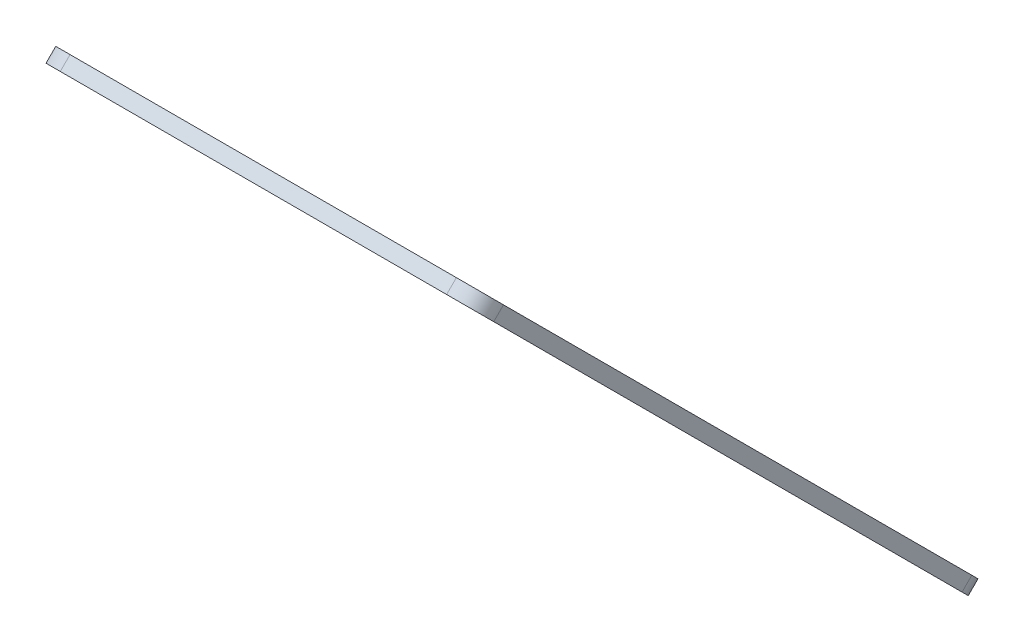
ISO-10303-21;
HEADER;
FILE_DESCRIPTION(('STEP AP214'),'2;1');
FILE_NAME('part.step','',(''),(''),'','','');
FILE_SCHEMA(('AUTOMOTIVE_DESIGN { 1 0 10303 214 1 1 1 1 }'));
ENDSEC;
DATA;
#1=APPLICATION_CONTEXT('core data for automotive mechanical design processes');
#2=APPLICATION_PROTOCOL_DEFINITION('international standard','automotive_design',2000,#1);
#3=PRODUCT_CONTEXT('',#1,'mechanical');
#4=PRODUCT('Part','Part','',(#3));
#5=PRODUCT_RELATED_PRODUCT_CATEGORY('part','',(#4));
#6=PRODUCT_DEFINITION_FORMATION('','',#4);
#7=PRODUCT_DEFINITION_CONTEXT('part definition',#1,'design');
#8=PRODUCT_DEFINITION('design','',#6,#7);
#9=PRODUCT_DEFINITION_SHAPE('','',#8);
#10=(LENGTH_UNIT() NAMED_UNIT(*) SI_UNIT(.MILLI.,.METRE.));
#11=(NAMED_UNIT(*) PLANE_ANGLE_UNIT() SI_UNIT($,.RADIAN.));
#12=(NAMED_UNIT(*) SI_UNIT($,.STERADIAN.) SOLID_ANGLE_UNIT());
#13=UNCERTAINTY_MEASURE_WITH_UNIT(LENGTH_MEASURE(1.E-05),#10,'distance_accuracy_value','');
#14=(GEOMETRIC_REPRESENTATION_CONTEXT(3) GLOBAL_UNCERTAINTY_ASSIGNED_CONTEXT((#13)) GLOBAL_UNIT_ASSIGNED_CONTEXT((#10,
#11,#12)) REPRESENTATION_CONTEXT('',''));
#15=CARTESIAN_POINT('',(0.,0.,0.));
#16=DIRECTION('',(0.,0.,1.));
#17=DIRECTION('',(1.,0.,0.));
#18=AXIS2_PLACEMENT_3D('',#15,#16,#17);
#19=CARTESIAN_POINT('',(42.5000000000001,114.111652351681,496.182720163548));
#20=DIRECTION('',(0.,0.707106781186544,-0.707106781186551));
#21=DIRECTION('',(0.,0.707106781186551,0.707106781186544));
#22=AXIS2_PLACEMENT_3D('',#19,#20,#21);
#23=PLANE('',#22);
#24=CARTESIAN_POINT('',(42.5000000000001,114.111652351681,496.182720163548));
#25=DIRECTION('',(0.,-0.707106781186544,0.707106781186551));
#26=DIRECTION('',(0.,0.707106781186551,0.707106781186544));
#27=AXIS2_PLACEMENT_3D('',#24,#25,#26);
#28=CIRCLE('',#27,10.);
#29=CARTESIAN_POINT('',(32.5000000000001,114.111652351681,496.182720163548));
#30=VERTEX_POINT('',#29);
#31=CARTESIAN_POINT('',(42.5000000000002,107.040584539815,489.111652351682));
#32=VERTEX_POINT('',#31);
#33=EDGE_CURVE('E166',#30,#32,#28,.T.);
#34=ORIENTED_EDGE('',*,*,#33,.T.);
#35=DIRECTION('',(1.,0.,0.));
#36=VECTOR('',#35,1.);
#37=CARTESIAN_POINT('',(42.5000000000002,107.040584539815,489.111652351682));
#38=LINE('',#37,#36);
#39=CARTESIAN_POINT('',(182.5,107.040584539816,489.111652351682));
#40=VERTEX_POINT('',#39);
#41=EDGE_CURVE('E101',#32,#40,#38,.T.);
#42=ORIENTED_EDGE('',*,*,#41,.T.);
#43=CARTESIAN_POINT('',(182.5,114.111652351681,496.182720163548));
#44=DIRECTION('',(0.,-0.707106781186544,0.707106781186551));
#45=DIRECTION('',(0.,-0.707106781186551,-0.707106781186544));
#46=AXIS2_PLACEMENT_3D('',#43,#44,#45);
#47=CIRCLE('',#46,10.);
#48=CARTESIAN_POINT('',(192.5,114.111652351681,496.182720163548));
#49=VERTEX_POINT('',#48);
#50=EDGE_CURVE('E189',#40,#49,#47,.T.);
#51=ORIENTED_EDGE('',*,*,#50,.T.);
#52=DIRECTION('',(0.,0.707106781186551,0.707106781186544));
#53=VECTOR('',#52,1.);
#54=CARTESIAN_POINT('',(192.5,114.111652351681,496.182720163548));
#55=LINE('',#54,#53);
#56=CARTESIAN_POINT('',(192.5,283.817279836454,665.888347648318));
#57=VERTEX_POINT('',#56);
#58=EDGE_CURVE('E202',#49,#57,#55,.T.);
#59=ORIENTED_EDGE('',*,*,#58,.T.);
#60=CARTESIAN_POINT('',(182.5,283.817279836454,665.888347648318));
#61=DIRECTION('',(0.,-0.707106781186544,0.707106781186551));
#62=DIRECTION('',(0.,0.707106781186551,0.707106781186544));
#63=AXIS2_PLACEMENT_3D('',#60,#61,#62);
#64=CIRCLE('',#63,9.99999999999999);
#65=CARTESIAN_POINT('',(182.5,290.888347648319,672.959415460184));
#66=VERTEX_POINT('',#65);
#67=EDGE_CURVE('E120',#57,#66,#64,.T.);
#68=ORIENTED_EDGE('',*,*,#67,.T.);
#69=DIRECTION('',(-1.,0.,0.));
#70=VECTOR('',#69,1.);
#71=CARTESIAN_POINT('',(42.5,290.888347648319,672.959415460184));
#72=LINE('',#71,#70);
#73=CARTESIAN_POINT('',(42.5,290.888347648319,672.959415460184));
#74=VERTEX_POINT('',#73);
#75=EDGE_CURVE('E114',#66,#74,#72,.T.);
#76=ORIENTED_EDGE('',*,*,#75,.T.);
#77=CARTESIAN_POINT('',(42.5,283.817279836453,665.888347648318));
#78=DIRECTION('',(0.,-0.707106781186544,0.707106781186551));
#79=DIRECTION('',(0.,0.707106781186551,0.707106781186544));
#80=AXIS2_PLACEMENT_3D('',#77,#78,#79);
#81=CIRCLE('',#80,9.99999999999998);
#82=CARTESIAN_POINT('',(32.5,283.817279836453,665.888347648318));
#83=VERTEX_POINT('',#82);
#84=EDGE_CURVE('E118',#74,#83,#81,.T.);
#85=ORIENTED_EDGE('',*,*,#84,.T.);
#86=DIRECTION('',(0.,-0.707106781186551,-0.707106781186544));
#87=VECTOR('',#86,1.);
#88=CARTESIAN_POINT('',(32.5000000000001,114.111652351681,496.182720163548));
#89=LINE('',#88,#87);
#90=EDGE_CURVE('E58',#83,#30,#89,.T.);
#91=ORIENTED_EDGE('',*,*,#90,.T.);
#92=EDGE_LOOP('',(#34,#42,#51,#59,#68,#76,#85,#91));
#93=FACE_BOUND('',#92,.T.);
#94=CARTESIAN_POINT('',(179.15,274.695602359147,656.766670171012));
#95=DIRECTION('',(0.,-0.707106781186544,0.707106781186551));
#96=DIRECTION('',(0.,-0.707106781186551,-0.707106781186544));
#97=AXIS2_PLACEMENT_3D('',#94,#95,#96);
#98=CIRCLE('',#97,2.70000000000003);
#99=CARTESIAN_POINT('',(179.15,272.786414049943,654.857481861808));
#100=VERTEX_POINT('',#99);
#101=EDGE_CURVE('E148',#100,#100,#98,.T.);
#102=ORIENTED_EDGE('',*,*,#101,.F.);
#103=EDGE_LOOP('',(#102));
#104=FACE_BOUND('',#103,.T.);
#105=CARTESIAN_POINT('',(45.85,274.695602359147,656.766670171012));
#106=DIRECTION('',(0.,-0.707106781186544,0.707106781186551));
#107=DIRECTION('',(0.,-0.707106781186551,-0.707106781186544));
#108=AXIS2_PLACEMENT_3D('',#105,#106,#107);
#109=CIRCLE('',#108,2.69999999999998);
#110=CARTESIAN_POINT('',(45.85,272.786414049943,654.857481861808));
#111=VERTEX_POINT('',#110);
#112=EDGE_CURVE('E217',#111,#111,#109,.T.);
#113=ORIENTED_EDGE('',*,*,#112,.F.);
#114=EDGE_LOOP('',(#113));
#115=FACE_BOUND('',#114,.T.);
#116=CARTESIAN_POINT('',(179.15,123.233329828988,505.304397640854));
#117=DIRECTION('',(0.,-0.707106781186544,0.707106781186551));
#118=DIRECTION('',(0.,-0.707106781186551,-0.707106781186544));
#119=AXIS2_PLACEMENT_3D('',#116,#117,#118);
#120=CIRCLE('',#119,2.70000000000002);
#121=CARTESIAN_POINT('',(179.15,121.324141519784,503.39520933165));
#122=VERTEX_POINT('',#121);
#123=EDGE_CURVE('E225',#122,#122,#120,.T.);
#124=ORIENTED_EDGE('',*,*,#123,.F.);
#125=EDGE_LOOP('',(#124));
#126=FACE_BOUND('',#125,.T.);
#127=CARTESIAN_POINT('',(45.8500000000001,123.233329828987,505.304397640854));
#128=DIRECTION('',(0.,-0.707106781186544,0.707106781186551));
#129=DIRECTION('',(0.,-0.707106781186551,-0.707106781186544));
#130=AXIS2_PLACEMENT_3D('',#127,#128,#129);
#131=CIRCLE('',#130,2.69999999999997);
#132=CARTESIAN_POINT('',(45.8500000000001,121.324141519784,503.395209331651));
#133=VERTEX_POINT('',#132);
#134=EDGE_CURVE('E233',#133,#133,#131,.T.);
#135=ORIENTED_EDGE('',*,*,#134,.F.);
#136=EDGE_LOOP('',(#135));
#137=FACE_BOUND('',#136,.T.);
#138=ADVANCED_FACE('F40',(#93,#104,#115,#126,#137),#23,.F.);
#139=CARTESIAN_POINT('',(42.5000000000001,117.647186257614,492.647186257615));
#140=DIRECTION('',(0.,0.707106781186544,-0.707106781186551));
#141=DIRECTION('',(0.,0.707106781186551,0.707106781186544));
#142=AXIS2_PLACEMENT_3D('',#139,#140,#141);
#143=PLANE('',#142);
#144=CARTESIAN_POINT('',(179.15,126.76886373492,501.768863734921));
#145=DIRECTION('',(0.,-0.707106781186544,0.707106781186551));
#146=DIRECTION('',(0.,-0.707106781186551,-0.707106781186544));
#147=AXIS2_PLACEMENT_3D('',#144,#145,#146);
#148=CIRCLE('',#147,2.70000000000002);
#149=CARTESIAN_POINT('',(179.15,124.859675425717,499.859675425718));
#150=VERTEX_POINT('',#149);
#151=EDGE_CURVE('E229',#150,#150,#148,.T.);
#152=ORIENTED_EDGE('',*,*,#151,.T.);
#153=EDGE_LOOP('',(#152));
#154=FACE_BOUND('',#153,.T.);
#155=CARTESIAN_POINT('',(179.15,278.23113626508,653.231136265079));
#156=DIRECTION('',(0.,-0.707106781186544,0.707106781186551));
#157=DIRECTION('',(0.,-0.707106781186551,-0.707106781186544));
#158=AXIS2_PLACEMENT_3D('',#155,#156,#157);
#159=CIRCLE('',#158,2.70000000000003);
#160=CARTESIAN_POINT('',(179.15,276.321947955876,651.321947955875));
#161=VERTEX_POINT('',#160);
#162=EDGE_CURVE('E213',#161,#161,#159,.T.);
#163=ORIENTED_EDGE('',*,*,#162,.T.);
#164=EDGE_LOOP('',(#163));
#165=FACE_BOUND('',#164,.T.);
#166=CARTESIAN_POINT('',(42.5000000000001,117.647186257614,492.647186257615));
#167=DIRECTION('',(0.,-0.707106781186544,0.707106781186551));
#168=DIRECTION('',(0.,0.707106781186551,0.707106781186544));
#169=AXIS2_PLACEMENT_3D('',#166,#167,#168);
#170=CIRCLE('',#169,10.);
#171=CARTESIAN_POINT('',(32.5000000000001,117.647186257614,492.647186257615));
#172=VERTEX_POINT('',#171);
#173=CARTESIAN_POINT('',(42.5000000000001,110.576118445748,485.57611844575));
#174=VERTEX_POINT('',#173);
#175=EDGE_CURVE('E143',#172,#174,#170,.T.);
#176=ORIENTED_EDGE('',*,*,#175,.F.);
#177=DIRECTION('',(0.,-0.707106781186551,-0.707106781186544));
#178=VECTOR('',#177,1.);
#179=CARTESIAN_POINT('',(32.5000000000001,117.647186257614,492.647186257615));
#180=LINE('',#179,#178);
#181=CARTESIAN_POINT('',(32.5,287.352813742386,662.352813742386));
#182=VERTEX_POINT('',#181);
#183=EDGE_CURVE('E93',#182,#172,#180,.T.);
#184=ORIENTED_EDGE('',*,*,#183,.F.);
#185=CARTESIAN_POINT('',(42.5,287.352813742386,662.352813742386));
#186=DIRECTION('',(0.,-0.707106781186544,0.707106781186551));
#187=DIRECTION('',(0.,0.707106781186551,0.707106781186544));
#188=AXIS2_PLACEMENT_3D('',#185,#186,#187);
#189=CIRCLE('',#188,9.99999999999998);
#190=CARTESIAN_POINT('',(42.5,294.423881554251,669.423881554251));
#191=VERTEX_POINT('',#190);
#192=EDGE_CURVE('E87',#191,#182,#189,.T.);
#193=ORIENTED_EDGE('',*,*,#192,.F.);
#194=DIRECTION('',(-1.,0.,0.));
#195=VECTOR('',#194,1.);
#196=CARTESIAN_POINT('',(42.5,294.423881554251,669.423881554251));
#197=LINE('',#196,#195);
#198=CARTESIAN_POINT('',(182.5,294.423881554252,669.423881554251));
#199=VERTEX_POINT('',#198);
#200=EDGE_CURVE('E129',#199,#191,#197,.T.);
#201=ORIENTED_EDGE('',*,*,#200,.F.);
#202=CARTESIAN_POINT('',(182.5,287.352813742386,662.352813742386));
#203=DIRECTION('',(0.,-0.707106781186544,0.707106781186551));
#204=DIRECTION('',(0.,0.707106781186551,0.707106781186544));
#205=AXIS2_PLACEMENT_3D('',#202,#203,#204);
#206=CIRCLE('',#205,9.99999999999999);
#207=CARTESIAN_POINT('',(192.5,287.352813742386,662.352813742386));
#208=VERTEX_POINT('',#207);
#209=EDGE_CURVE('E157',#208,#199,#206,.T.);
#210=ORIENTED_EDGE('',*,*,#209,.F.);
#211=DIRECTION('',(0.,0.707106781186551,0.707106781186544));
#212=VECTOR('',#211,1.);
#213=CARTESIAN_POINT('',(192.5,117.647186257614,492.647186257615));
#214=LINE('',#213,#212);
#215=CARTESIAN_POINT('',(192.5,117.647186257614,492.647186257615));
#216=VERTEX_POINT('',#215);
#217=EDGE_CURVE('E154',#216,#208,#214,.T.);
#218=ORIENTED_EDGE('',*,*,#217,.F.);
#219=CARTESIAN_POINT('',(182.5,117.647186257614,492.647186257615));
#220=DIRECTION('',(0.,-0.707106781186544,0.707106781186551));
#221=DIRECTION('',(0.,-0.707106781186551,-0.707106781186544));
#222=AXIS2_PLACEMENT_3D('',#219,#220,#221);
#223=CIRCLE('',#222,10.);
#224=CARTESIAN_POINT('',(182.5,110.576118445748,485.57611844575));
#225=VERTEX_POINT('',#224);
#226=EDGE_CURVE('E151',#225,#216,#223,.T.);
#227=ORIENTED_EDGE('',*,*,#226,.F.);
#228=DIRECTION('',(1.,0.,0.));
#229=VECTOR('',#228,1.);
#230=CARTESIAN_POINT('',(42.5000000000001,110.576118445748,485.57611844575));
#231=LINE('',#230,#229);
#232=EDGE_CURVE('E147',#174,#225,#231,.T.);
#233=ORIENTED_EDGE('',*,*,#232,.F.);
#234=EDGE_LOOP('',(#176,#184,#193,#201,#210,#218,#227,#233));
#235=FACE_BOUND('',#234,.T.);
#236=CARTESIAN_POINT('',(45.85,278.231136265079,653.231136265079));
#237=DIRECTION('',(0.,-0.707106781186544,0.707106781186551));
#238=DIRECTION('',(0.,-0.707106781186551,-0.707106781186544));
#239=AXIS2_PLACEMENT_3D('',#236,#237,#238);
#240=CIRCLE('',#239,2.69999999999998);
#241=CARTESIAN_POINT('',(45.85,276.321947955876,651.321947955876));
#242=VERTEX_POINT('',#241);
#243=EDGE_CURVE('E221',#242,#242,#240,.T.);
#244=ORIENTED_EDGE('',*,*,#243,.T.);
#245=EDGE_LOOP('',(#244));
#246=FACE_BOUND('',#245,.T.);
#247=CARTESIAN_POINT('',(45.8500000000001,126.76886373492,501.768863734921));
#248=DIRECTION('',(0.,-0.707106781186544,0.707106781186551));
#249=DIRECTION('',(0.,-0.707106781186551,-0.707106781186544));
#250=AXIS2_PLACEMENT_3D('',#247,#248,#249);
#251=CIRCLE('',#250,2.69999999999997);
#252=CARTESIAN_POINT('',(45.8500000000001,124.859675425716,499.859675425718));
#253=VERTEX_POINT('',#252);
#254=EDGE_CURVE('E237',#253,#253,#251,.T.);
#255=ORIENTED_EDGE('',*,*,#254,.T.);
#256=EDGE_LOOP('',(#255));
#257=FACE_BOUND('',#256,.T.);
#258=ADVANCED_FACE('F193',(#154,#165,#235,#246,#257),#143,.T.);
#259=CARTESIAN_POINT('',(42.5000000000001,114.111652351681,496.182720163548));
#260=DIRECTION('',(0.,0.707106781186544,-0.707106781186551));
#261=DIRECTION('',(0.,0.707106781186551,0.707106781186544));
#262=AXIS2_PLACEMENT_3D('',#259,#260,#261);
#263=CYLINDRICAL_SURFACE('',#262,10.);
#264=ORIENTED_EDGE('',*,*,#175,.T.);
#265=DIRECTION('',(0.,0.707106781186544,-0.707106781186551));
#266=VECTOR('',#265,1.);
#267=CARTESIAN_POINT('',(42.5000000000002,107.040584539815,489.111652351682));
#268=LINE('',#267,#266);
#269=EDGE_CURVE('E11',#32,#174,#268,.T.);
#270=ORIENTED_EDGE('',*,*,#269,.F.);
#271=ORIENTED_EDGE('',*,*,#33,.F.);
#272=DIRECTION('',(0.,0.707106781186544,-0.707106781186551));
#273=VECTOR('',#272,1.);
#274=CARTESIAN_POINT('',(32.5000000000001,114.111652351681,496.182720163548));
#275=LINE('',#274,#273);
#276=EDGE_CURVE('E139',#30,#172,#275,.T.);
#277=ORIENTED_EDGE('',*,*,#276,.T.);
#278=EDGE_LOOP('',(#264,#270,#271,#277));
#279=FACE_BOUND('',#278,.T.);
#280=ADVANCED_FACE('F42',(#279),#263,.T.);
#281=CARTESIAN_POINT('',(42.5000000000002,107.040584539815,489.111652351682));
#282=DIRECTION('',(0.,0.707106781186551,0.707106781186544));
#283=DIRECTION('',(0.,-0.707106781186544,0.707106781186551));
#284=AXIS2_PLACEMENT_3D('',#281,#282,#283);
#285=PLANE('',#284);
#286=ORIENTED_EDGE('',*,*,#232,.T.);
#287=DIRECTION('',(0.,0.707106781186544,-0.707106781186551));
#288=VECTOR('',#287,1.);
#289=CARTESIAN_POINT('',(182.5,107.040584539816,489.111652351682));
#290=LINE('',#289,#288);
#291=EDGE_CURVE('E50',#40,#225,#290,.T.);
#292=ORIENTED_EDGE('',*,*,#291,.F.);
#293=ORIENTED_EDGE('',*,*,#41,.F.);
#294=ORIENTED_EDGE('',*,*,#269,.T.);
#295=EDGE_LOOP('',(#286,#292,#293,#294));
#296=FACE_BOUND('',#295,.T.);
#297=ADVANCED_FACE('F272',(#296),#285,.F.);
#298=CARTESIAN_POINT('',(182.5,114.111652351681,496.182720163548));
#299=DIRECTION('',(0.,0.707106781186544,-0.707106781186551));
#300=DIRECTION('',(0.,0.707106781186551,0.707106781186544));
#301=AXIS2_PLACEMENT_3D('',#298,#299,#300);
#302=CYLINDRICAL_SURFACE('',#301,10.);
#303=ORIENTED_EDGE('',*,*,#226,.T.);
#304=DIRECTION('',(0.,0.707106781186544,-0.707106781186551));
#305=VECTOR('',#304,1.);
#306=CARTESIAN_POINT('',(192.5,114.111652351681,496.182720163548));
#307=LINE('',#306,#305);
#308=EDGE_CURVE('E177',#49,#216,#307,.T.);
#309=ORIENTED_EDGE('',*,*,#308,.F.);
#310=ORIENTED_EDGE('',*,*,#50,.F.);
#311=ORIENTED_EDGE('',*,*,#291,.T.);
#312=EDGE_LOOP('',(#303,#309,#310,#311));
#313=FACE_BOUND('',#312,.T.);
#314=ADVANCED_FACE('F187',(#313),#302,.T.);
#315=CARTESIAN_POINT('',(192.5,114.111652351681,496.182720163548));
#316=DIRECTION('',(-1.,0.,0.));
#317=DIRECTION('',(0.,-1.,0.));
#318=AXIS2_PLACEMENT_3D('',#315,#316,#317);
#319=PLANE('',#318);
#320=ORIENTED_EDGE('',*,*,#217,.T.);
#321=DIRECTION('',(0.,0.707106781186544,-0.707106781186551));
#322=VECTOR('',#321,1.);
#323=CARTESIAN_POINT('',(192.5,283.817279836454,665.888347648318));
#324=LINE('',#323,#322);
#325=EDGE_CURVE('E173',#57,#208,#324,.T.);
#326=ORIENTED_EDGE('',*,*,#325,.F.);
#327=ORIENTED_EDGE('',*,*,#58,.F.);
#328=ORIENTED_EDGE('',*,*,#308,.T.);
#329=EDGE_LOOP('',(#320,#326,#327,#328));
#330=FACE_BOUND('',#329,.T.);
#331=ADVANCED_FACE('F198',(#330),#319,.F.);
#332=CARTESIAN_POINT('',(182.5,283.817279836454,665.888347648318));
#333=DIRECTION('',(0.,0.707106781186544,-0.707106781186551));
#334=DIRECTION('',(0.,0.707106781186551,0.707106781186544));
#335=AXIS2_PLACEMENT_3D('',#332,#333,#334);
#336=CYLINDRICAL_SURFACE('',#335,9.99999999999999);
#337=ORIENTED_EDGE('',*,*,#209,.T.);
#338=DIRECTION('',(0.,0.707106781186544,-0.707106781186551));
#339=VECTOR('',#338,1.);
#340=CARTESIAN_POINT('',(182.5,290.888347648319,672.959415460184));
#341=LINE('',#340,#339);
#342=EDGE_CURVE('E131',#66,#199,#341,.T.);
#343=ORIENTED_EDGE('',*,*,#342,.F.);
#344=ORIENTED_EDGE('',*,*,#67,.F.);
#345=ORIENTED_EDGE('',*,*,#325,.T.);
#346=EDGE_LOOP('',(#337,#343,#344,#345));
#347=FACE_BOUND('',#346,.T.);
#348=ADVANCED_FACE('F201',(#347),#336,.T.);
#349=CARTESIAN_POINT('',(42.5,290.888347648319,672.959415460184));
#350=DIRECTION('',(0.,-0.707106781186551,-0.707106781186544));
#351=DIRECTION('',(0.,0.707106781186544,-0.707106781186551));
#352=AXIS2_PLACEMENT_3D('',#349,#350,#351);
#353=PLANE('',#352);
#354=ORIENTED_EDGE('',*,*,#200,.T.);
#355=DIRECTION('',(0.,0.707106781186544,-0.707106781186551));
#356=VECTOR('',#355,1.);
#357=CARTESIAN_POINT('',(42.5,290.888347648319,672.959415460184));
#358=LINE('',#357,#356);
#359=EDGE_CURVE('E126',#74,#191,#358,.T.);
#360=ORIENTED_EDGE('',*,*,#359,.F.);
#361=ORIENTED_EDGE('',*,*,#75,.F.);
#362=ORIENTED_EDGE('',*,*,#342,.T.);
#363=EDGE_LOOP('',(#354,#360,#361,#362));
#364=FACE_BOUND('',#363,.T.);
#365=ADVANCED_FACE('F127',(#364),#353,.F.);
#366=CARTESIAN_POINT('',(42.5,283.817279836453,665.888347648318));
#367=DIRECTION('',(0.,0.707106781186544,-0.707106781186551));
#368=DIRECTION('',(0.,0.707106781186551,0.707106781186544));
#369=AXIS2_PLACEMENT_3D('',#366,#367,#368);
#370=CYLINDRICAL_SURFACE('',#369,9.99999999999998);
#371=ORIENTED_EDGE('',*,*,#192,.T.);
#372=DIRECTION('',(0.,0.707106781186544,-0.707106781186551));
#373=VECTOR('',#372,1.);
#374=CARTESIAN_POINT('',(32.5,283.817279836453,665.888347648318));
#375=LINE('',#374,#373);
#376=EDGE_CURVE('E132',#83,#182,#375,.T.);
#377=ORIENTED_EDGE('',*,*,#376,.F.);
#378=ORIENTED_EDGE('',*,*,#84,.F.);
#379=ORIENTED_EDGE('',*,*,#359,.T.);
#380=EDGE_LOOP('',(#371,#377,#378,#379));
#381=FACE_BOUND('',#380,.T.);
#382=ADVANCED_FACE('F134',(#381),#370,.T.);
#383=CARTESIAN_POINT('',(32.5000000000001,114.111652351681,496.182720163548));
#384=DIRECTION('',(1.,0.,0.));
#385=DIRECTION('',(0.,1.,0.));
#386=AXIS2_PLACEMENT_3D('',#383,#384,#385);
#387=PLANE('',#386);
#388=ORIENTED_EDGE('',*,*,#183,.T.);
#389=ORIENTED_EDGE('',*,*,#276,.F.);
#390=ORIENTED_EDGE('',*,*,#90,.F.);
#391=ORIENTED_EDGE('',*,*,#376,.T.);
#392=EDGE_LOOP('',(#388,#389,#390,#391));
#393=FACE_BOUND('',#392,.T.);
#394=ADVANCED_FACE('F260',(#393),#387,.F.);
#395=CARTESIAN_POINT('',(179.15,274.695602359147,656.766670171012));
#396=DIRECTION('',(0.,0.707106781186544,-0.707106781186551));
#397=DIRECTION('',(0.,0.707106781186551,0.707106781186544));
#398=AXIS2_PLACEMENT_3D('',#395,#396,#397);
#399=CYLINDRICAL_SURFACE('',#398,2.70000000000003);
#400=ORIENTED_EDGE('',*,*,#101,.T.);
#401=EDGE_LOOP('',(#400));
#402=FACE_BOUND('',#401,.T.);
#403=ORIENTED_EDGE('',*,*,#162,.F.);
#404=EDGE_LOOP('',(#403));
#405=FACE_BOUND('',#404,.T.);
#406=ADVANCED_FACE('F257',(#402,#405),#399,.F.);
#407=CARTESIAN_POINT('',(45.85,274.695602359147,656.766670171012));
#408=DIRECTION('',(0.,0.707106781186544,-0.707106781186551));
#409=DIRECTION('',(0.,0.707106781186551,0.707106781186544));
#410=AXIS2_PLACEMENT_3D('',#407,#408,#409);
#411=CYLINDRICAL_SURFACE('',#410,2.69999999999998);
#412=ORIENTED_EDGE('',*,*,#112,.T.);
#413=EDGE_LOOP('',(#412));
#414=FACE_BOUND('',#413,.T.);
#415=ORIENTED_EDGE('',*,*,#243,.F.);
#416=EDGE_LOOP('',(#415));
#417=FACE_BOUND('',#416,.T.);
#418=ADVANCED_FACE('F362',(#414,#417),#411,.F.);
#419=CARTESIAN_POINT('',(179.15,123.233329828988,505.304397640854));
#420=DIRECTION('',(0.,0.707106781186544,-0.707106781186551));
#421=DIRECTION('',(0.,0.707106781186551,0.707106781186544));
#422=AXIS2_PLACEMENT_3D('',#419,#420,#421);
#423=CYLINDRICAL_SURFACE('',#422,2.70000000000002);
#424=ORIENTED_EDGE('',*,*,#123,.T.);
#425=EDGE_LOOP('',(#424));
#426=FACE_BOUND('',#425,.T.);
#427=ORIENTED_EDGE('',*,*,#151,.F.);
#428=EDGE_LOOP('',(#427));
#429=FACE_BOUND('',#428,.T.);
#430=ADVANCED_FACE('F372',(#426,#429),#423,.F.);
#431=CARTESIAN_POINT('',(45.8500000000001,123.233329828987,505.304397640854));
#432=DIRECTION('',(0.,0.707106781186544,-0.707106781186551));
#433=DIRECTION('',(0.,0.707106781186551,0.707106781186544));
#434=AXIS2_PLACEMENT_3D('',#431,#432,#433);
#435=CYLINDRICAL_SURFACE('',#434,2.69999999999997);
#436=ORIENTED_EDGE('',*,*,#134,.T.);
#437=EDGE_LOOP('',(#436));
#438=FACE_BOUND('',#437,.T.);
#439=ORIENTED_EDGE('',*,*,#254,.F.);
#440=EDGE_LOOP('',(#439));
#441=FACE_BOUND('',#440,.T.);
#442=ADVANCED_FACE('F246',(#438,#441),#435,.F.);
#443=CLOSED_SHELL('',(#138,#258,#280,#297,#314,#331,#348,#365,#382,#394,#406,#418,#430,#442));
#444=MANIFOLD_SOLID_BREP('B2',#443);
#445=ADVANCED_BREP_SHAPE_REPRESENTATION('',(#18,#444),#14);
#446=SHAPE_DEFINITION_REPRESENTATION(#9,#445);
ENDSEC;
END-ISO-10303-21;
